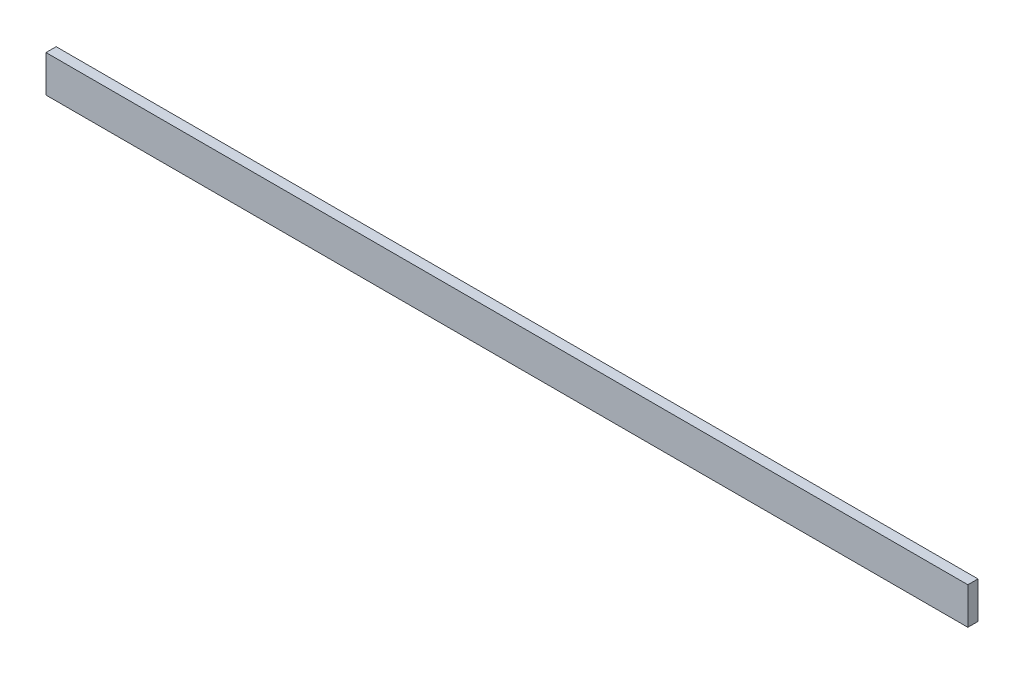
ISO-10303-21;
HEADER;
FILE_DESCRIPTION(('STEP AP214'),'2;1');
FILE_NAME('part.step','',(''),(''),'','','');
FILE_SCHEMA(('AUTOMOTIVE_DESIGN { 1 0 10303 214 1 1 1 1 }'));
ENDSEC;
DATA;
#1=APPLICATION_CONTEXT('core data for automotive mechanical design processes');
#2=APPLICATION_PROTOCOL_DEFINITION('international standard','automotive_design',2000,#1);
#3=PRODUCT_CONTEXT('',#1,'mechanical');
#4=PRODUCT('Part','Part','',(#3));
#5=PRODUCT_RELATED_PRODUCT_CATEGORY('part','',(#4));
#6=PRODUCT_DEFINITION_FORMATION('','',#4);
#7=PRODUCT_DEFINITION_CONTEXT('part definition',#1,'design');
#8=PRODUCT_DEFINITION('design','',#6,#7);
#9=PRODUCT_DEFINITION_SHAPE('','',#8);
#10=(LENGTH_UNIT() NAMED_UNIT(*) SI_UNIT(.MILLI.,.METRE.));
#11=(NAMED_UNIT(*) PLANE_ANGLE_UNIT() SI_UNIT($,.RADIAN.));
#12=(NAMED_UNIT(*) SI_UNIT($,.STERADIAN.) SOLID_ANGLE_UNIT());
#13=UNCERTAINTY_MEASURE_WITH_UNIT(LENGTH_MEASURE(1.E-05),#10,'distance_accuracy_value','');
#14=(GEOMETRIC_REPRESENTATION_CONTEXT(3) GLOBAL_UNCERTAINTY_ASSIGNED_CONTEXT((#13)) GLOBAL_UNIT_ASSIGNED_CONTEXT((#10,
#11,#12)) REPRESENTATION_CONTEXT('',''));
#15=CARTESIAN_POINT('',(0.,0.,0.));
#16=DIRECTION('',(0.,0.,1.));
#17=DIRECTION('',(1.,0.,0.));
#18=AXIS2_PLACEMENT_3D('',#15,#16,#17);
#19=CARTESIAN_POINT('',(0.,0.,22.));
#20=DIRECTION('',(1.,0.,0.));
#21=DIRECTION('',(0.,0.,-1.));
#22=AXIS2_PLACEMENT_3D('',#19,#20,#21);
#23=PLANE('',#22);
#24=DIRECTION('',(0.,-1.,0.));
#25=VECTOR('',#24,1.);
#26=CARTESIAN_POINT('',(0.,0.,0.));
#27=LINE('',#26,#25);
#28=CARTESIAN_POINT('',(0.,80.,0.));
#29=VERTEX_POINT('',#28);
#30=CARTESIAN_POINT('',(0.,0.,0.));
#31=VERTEX_POINT('',#30);
#32=EDGE_CURVE('E95',#29,#31,#27,.T.);
#33=ORIENTED_EDGE('',*,*,#32,.T.);
#34=DIRECTION('',(0.,0.,-1.));
#35=VECTOR('',#34,1.);
#36=CARTESIAN_POINT('',(0.,0.,22.));
#37=LINE('',#36,#35);
#38=CARTESIAN_POINT('',(0.,0.,22.));
#39=VERTEX_POINT('',#38);
#40=EDGE_CURVE('E11',#39,#31,#37,.T.);
#41=ORIENTED_EDGE('',*,*,#40,.F.);
#42=DIRECTION('',(0.,-1.,0.));
#43=VECTOR('',#42,1.);
#44=CARTESIAN_POINT('',(0.,0.,22.));
#45=LINE('',#44,#43);
#46=CARTESIAN_POINT('',(0.,80.,22.));
#47=VERTEX_POINT('',#46);
#48=EDGE_CURVE('E83',#47,#39,#45,.T.);
#49=ORIENTED_EDGE('',*,*,#48,.F.);
#50=DIRECTION('',(0.,0.,-1.));
#51=VECTOR('',#50,1.);
#52=CARTESIAN_POINT('',(0.,80.,22.));
#53=LINE('',#52,#51);
#54=EDGE_CURVE('E91',#47,#29,#53,.T.);
#55=ORIENTED_EDGE('',*,*,#54,.T.);
#56=EDGE_LOOP('',(#33,#41,#49,#55));
#57=FACE_BOUND('',#56,.T.);
#58=ADVANCED_FACE('F32',(#57),#23,.F.);
#59=CARTESIAN_POINT('',(0.,0.,22.));
#60=DIRECTION('',(0.,1.,0.));
#61=DIRECTION('',(0.,0.,1.));
#62=AXIS2_PLACEMENT_3D('',#59,#60,#61);
#63=PLANE('',#62);
#64=DIRECTION('',(1.,0.,0.));
#65=VECTOR('',#64,1.);
#66=CARTESIAN_POINT('',(0.,0.,0.));
#67=LINE('',#66,#65);
#68=CARTESIAN_POINT('',(2000.,0.,0.));
#69=VERTEX_POINT('',#68);
#70=EDGE_CURVE('E87',#31,#69,#67,.T.);
#71=ORIENTED_EDGE('',*,*,#70,.T.);
#72=DIRECTION('',(0.,0.,-1.));
#73=VECTOR('',#72,1.);
#74=CARTESIAN_POINT('',(2000.,0.,22.));
#75=LINE('',#74,#73);
#76=CARTESIAN_POINT('',(2000.,0.,22.));
#77=VERTEX_POINT('',#76);
#78=EDGE_CURVE('E40',#77,#69,#75,.T.);
#79=ORIENTED_EDGE('',*,*,#78,.F.);
#80=DIRECTION('',(1.,0.,0.));
#81=VECTOR('',#80,1.);
#82=CARTESIAN_POINT('',(0.,0.,22.));
#83=LINE('',#82,#81);
#84=EDGE_CURVE('E78',#39,#77,#83,.T.);
#85=ORIENTED_EDGE('',*,*,#84,.F.);
#86=ORIENTED_EDGE('',*,*,#40,.T.);
#87=EDGE_LOOP('',(#71,#79,#85,#86));
#88=FACE_BOUND('',#87,.T.);
#89=ADVANCED_FACE('F86',(#88),#63,.F.);
#90=CARTESIAN_POINT('',(2000.,0.,22.));
#91=DIRECTION('',(-1.,0.,0.));
#92=DIRECTION('',(0.,0.,1.));
#93=AXIS2_PLACEMENT_3D('',#90,#91,#92);
#94=PLANE('',#93);
#95=DIRECTION('',(0.,1.,0.));
#96=VECTOR('',#95,1.);
#97=CARTESIAN_POINT('',(2000.,0.,0.));
#98=LINE('',#97,#96);
#99=CARTESIAN_POINT('',(2000.,80.,0.));
#100=VERTEX_POINT('',#99);
#101=EDGE_CURVE('E65',#69,#100,#98,.T.);
#102=ORIENTED_EDGE('',*,*,#101,.T.);
#103=DIRECTION('',(0.,0.,-1.));
#104=VECTOR('',#103,1.);
#105=CARTESIAN_POINT('',(2000.,80.,22.));
#106=LINE('',#105,#104);
#107=CARTESIAN_POINT('',(2000.,80.,22.));
#108=VERTEX_POINT('',#107);
#109=EDGE_CURVE('E88',#108,#100,#106,.T.);
#110=ORIENTED_EDGE('',*,*,#109,.F.);
#111=DIRECTION('',(0.,1.,0.));
#112=VECTOR('',#111,1.);
#113=CARTESIAN_POINT('',(2000.,0.,22.));
#114=LINE('',#113,#112);
#115=EDGE_CURVE('E81',#77,#108,#114,.T.);
#116=ORIENTED_EDGE('',*,*,#115,.F.);
#117=ORIENTED_EDGE('',*,*,#78,.T.);
#118=EDGE_LOOP('',(#102,#110,#116,#117));
#119=FACE_BOUND('',#118,.T.);
#120=ADVANCED_FACE('F89',(#119),#94,.F.);
#121=CARTESIAN_POINT('',(0.,80.,22.));
#122=DIRECTION('',(0.,-1.,0.));
#123=DIRECTION('',(0.,0.,-1.));
#124=AXIS2_PLACEMENT_3D('',#121,#122,#123);
#125=PLANE('',#124);
#126=DIRECTION('',(-1.,0.,0.));
#127=VECTOR('',#126,1.);
#128=CARTESIAN_POINT('',(0.,80.,0.));
#129=LINE('',#128,#127);
#130=EDGE_CURVE('E71',#100,#29,#129,.T.);
#131=ORIENTED_EDGE('',*,*,#130,.T.);
#132=ORIENTED_EDGE('',*,*,#54,.F.);
#133=DIRECTION('',(-1.,0.,0.));
#134=VECTOR('',#133,1.);
#135=CARTESIAN_POINT('',(0.,80.,22.));
#136=LINE('',#135,#134);
#137=EDGE_CURVE('E48',#108,#47,#136,.T.);
#138=ORIENTED_EDGE('',*,*,#137,.F.);
#139=ORIENTED_EDGE('',*,*,#109,.T.);
#140=EDGE_LOOP('',(#131,#132,#138,#139));
#141=FACE_BOUND('',#140,.T.);
#142=ADVANCED_FACE('F102',(#141),#125,.F.);
#143=CARTESIAN_POINT('',(0.,80.,22.));
#144=DIRECTION('',(0.,0.,-1.));
#145=DIRECTION('',(-1.,0.,0.));
#146=AXIS2_PLACEMENT_3D('',#143,#144,#145);
#147=PLANE('',#146);
#148=ORIENTED_EDGE('',*,*,#48,.T.);
#149=ORIENTED_EDGE('',*,*,#84,.T.);
#150=ORIENTED_EDGE('',*,*,#115,.T.);
#151=ORIENTED_EDGE('',*,*,#137,.T.);
#152=EDGE_LOOP('',(#148,#149,#150,#151));
#153=FACE_BOUND('',#152,.T.);
#154=ADVANCED_FACE('F79',(#153),#147,.F.);
#155=CARTESIAN_POINT('',(0.,80.,0.));
#156=DIRECTION('',(0.,0.,-1.));
#157=DIRECTION('',(-1.,0.,0.));
#158=AXIS2_PLACEMENT_3D('',#155,#156,#157);
#159=PLANE('',#158);
#160=ORIENTED_EDGE('',*,*,#32,.F.);
#161=ORIENTED_EDGE('',*,*,#130,.F.);
#162=ORIENTED_EDGE('',*,*,#101,.F.);
#163=ORIENTED_EDGE('',*,*,#70,.F.);
#164=EDGE_LOOP('',(#160,#161,#162,#163));
#165=FACE_BOUND('',#164,.T.);
#166=ADVANCED_FACE('F105',(#165),#159,.T.);
#167=CLOSED_SHELL('',(#58,#89,#120,#142,#154,#166));
#168=MANIFOLD_SOLID_BREP('B2',#167);
#169=ADVANCED_BREP_SHAPE_REPRESENTATION('',(#18,#168),#14);
#170=SHAPE_DEFINITION_REPRESENTATION(#9,#169);
ENDSEC;
END-ISO-10303-21;
